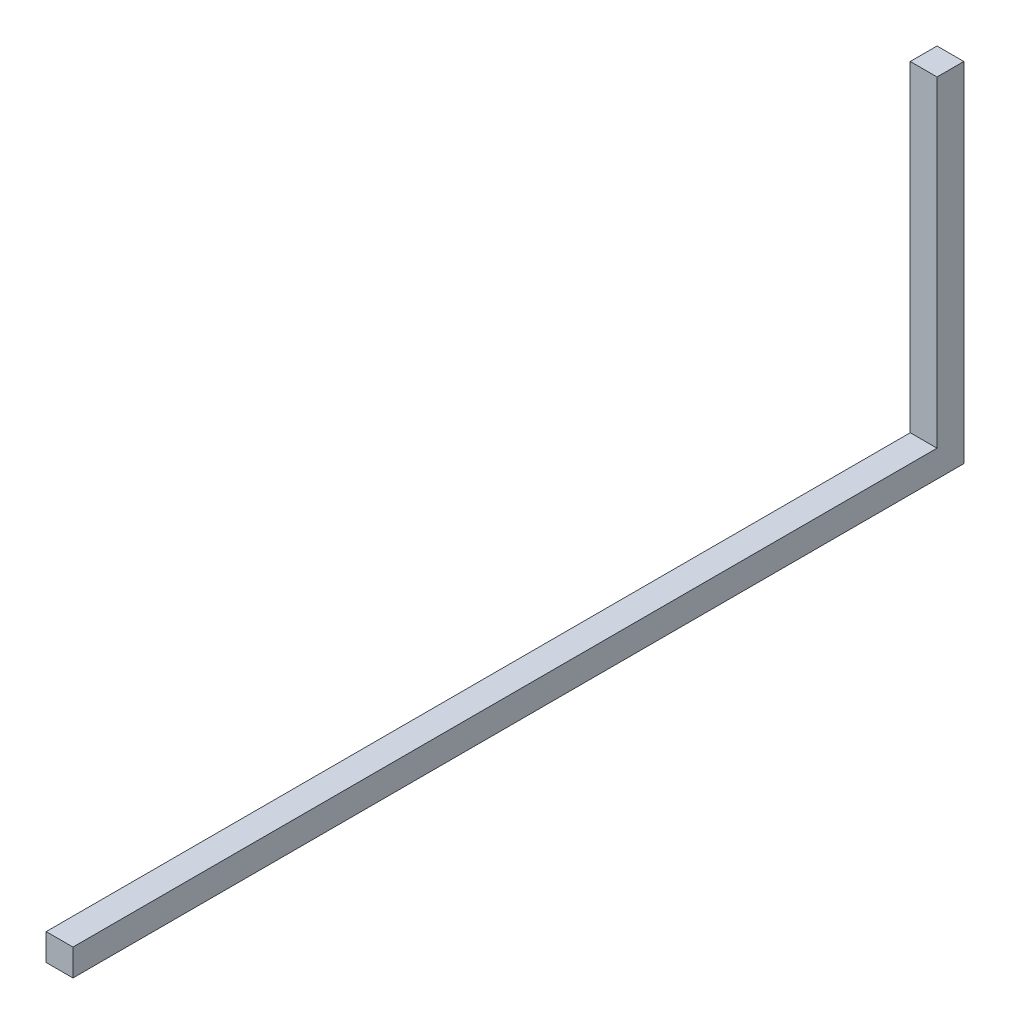
ISO-10303-21;
HEADER;
FILE_DESCRIPTION(('STEP AP214'),'2;1');
FILE_NAME('part.step','',(''),(''),'','','');
FILE_SCHEMA(('AUTOMOTIVE_DESIGN { 1 0 10303 214 1 1 1 1 }'));
ENDSEC;
DATA;
#1=APPLICATION_CONTEXT('core data for automotive mechanical design processes');
#2=APPLICATION_PROTOCOL_DEFINITION('international standard','automotive_design',2000,#1);
#3=PRODUCT_CONTEXT('',#1,'mechanical');
#4=PRODUCT('Part','Part','',(#3));
#5=PRODUCT_RELATED_PRODUCT_CATEGORY('part','',(#4));
#6=PRODUCT_DEFINITION_FORMATION('','',#4);
#7=PRODUCT_DEFINITION_CONTEXT('part definition',#1,'design');
#8=PRODUCT_DEFINITION('design','',#6,#7);
#9=PRODUCT_DEFINITION_SHAPE('','',#8);
#10=(LENGTH_UNIT() NAMED_UNIT(*) SI_UNIT(.MILLI.,.METRE.));
#11=(NAMED_UNIT(*) PLANE_ANGLE_UNIT() SI_UNIT($,.RADIAN.));
#12=(NAMED_UNIT(*) SI_UNIT($,.STERADIAN.) SOLID_ANGLE_UNIT());
#13=UNCERTAINTY_MEASURE_WITH_UNIT(LENGTH_MEASURE(1.E-05),#10,'distance_accuracy_value','');
#14=(GEOMETRIC_REPRESENTATION_CONTEXT(3) GLOBAL_UNCERTAINTY_ASSIGNED_CONTEXT((#13)) GLOBAL_UNIT_ASSIGNED_CONTEXT((#10,
#11,#12)) REPRESENTATION_CONTEXT('',''));
#15=CARTESIAN_POINT('',(0.,0.,0.));
#16=DIRECTION('',(0.,0.,1.));
#17=DIRECTION('',(1.,0.,0.));
#18=AXIS2_PLACEMENT_3D('',#15,#16,#17);
#19=CARTESIAN_POINT('',(-0.2,-0.2,-13.3));
#20=DIRECTION('',(0.,0.,1.));
#21=DIRECTION('',(1.,0.,0.));
#22=AXIS2_PLACEMENT_3D('',#19,#20,#21);
#23=PLANE('',#22);
#24=DIRECTION('',(-1.,0.,0.));
#25=VECTOR('',#24,1.);
#26=CARTESIAN_POINT('',(-0.2,5.,-13.3));
#27=LINE('',#26,#25);
#28=CARTESIAN_POINT('',(0.2,5.,-13.3));
#29=VERTEX_POINT('',#28);
#30=CARTESIAN_POINT('',(-0.2,5.,-13.3));
#31=VERTEX_POINT('',#30);
#32=EDGE_CURVE('E130',#29,#31,#27,.T.);
#33=ORIENTED_EDGE('',*,*,#32,.F.);
#34=DIRECTION('',(0.,1.,0.));
#35=VECTOR('',#34,1.);
#36=CARTESIAN_POINT('',(0.2,-0.2,-13.3));
#37=LINE('',#36,#35);
#38=CARTESIAN_POINT('',(0.2,-0.2,-13.3));
#39=VERTEX_POINT('',#38);
#40=EDGE_CURVE('E121',#39,#29,#37,.T.);
#41=ORIENTED_EDGE('',*,*,#40,.F.);
#42=DIRECTION('',(1.,0.,0.));
#43=VECTOR('',#42,1.);
#44=CARTESIAN_POINT('',(-0.2,-0.2,-13.3));
#45=LINE('',#44,#43);
#46=CARTESIAN_POINT('',(-0.2,-0.2,-13.3));
#47=VERTEX_POINT('',#46);
#48=EDGE_CURVE('E110',#47,#39,#45,.T.);
#49=ORIENTED_EDGE('',*,*,#48,.F.);
#50=DIRECTION('',(0.,1.,0.));
#51=VECTOR('',#50,1.);
#52=CARTESIAN_POINT('',(-0.2,-0.2,-13.3));
#53=LINE('',#52,#51);
#54=EDGE_CURVE('E90',#47,#31,#53,.T.);
#55=ORIENTED_EDGE('',*,*,#54,.T.);
#56=EDGE_LOOP('',(#33,#41,#49,#55));
#57=FACE_BOUND('',#56,.T.);
#58=ADVANCED_FACE('F34',(#57),#23,.F.);
#59=CARTESIAN_POINT('',(-0.2,0.2,-12.9));
#60=DIRECTION('',(0.,0.,-1.));
#61=DIRECTION('',(-1.,0.,0.));
#62=AXIS2_PLACEMENT_3D('',#59,#60,#61);
#63=PLANE('',#62);
#64=DIRECTION('',(1.,0.,0.));
#65=VECTOR('',#64,1.);
#66=CARTESIAN_POINT('',(-0.2,5.,-12.9));
#67=LINE('',#66,#65);
#68=CARTESIAN_POINT('',(-0.2,5.,-12.9));
#69=VERTEX_POINT('',#68);
#70=CARTESIAN_POINT('',(0.2,5.,-12.9));
#71=VERTEX_POINT('',#70);
#72=EDGE_CURVE('E12',#69,#71,#67,.T.);
#73=ORIENTED_EDGE('',*,*,#72,.F.);
#74=DIRECTION('',(0.,1.,0.));
#75=VECTOR('',#74,1.);
#76=CARTESIAN_POINT('',(-0.2,0.2,-12.9));
#77=LINE('',#76,#75);
#78=CARTESIAN_POINT('',(-0.2,0.2,-12.9));
#79=VERTEX_POINT('',#78);
#80=EDGE_CURVE('E127',#79,#69,#77,.T.);
#81=ORIENTED_EDGE('',*,*,#80,.F.);
#82=DIRECTION('',(-1.,0.,0.));
#83=VECTOR('',#82,1.);
#84=CARTESIAN_POINT('',(-0.2,0.2,-12.9));
#85=LINE('',#84,#83);
#86=CARTESIAN_POINT('',(0.2,0.2,-12.9));
#87=VERTEX_POINT('',#86);
#88=EDGE_CURVE('E122',#87,#79,#85,.T.);
#89=ORIENTED_EDGE('',*,*,#88,.F.);
#90=DIRECTION('',(0.,1.,0.));
#91=VECTOR('',#90,1.);
#92=CARTESIAN_POINT('',(0.2,0.2,-12.9));
#93=LINE('',#92,#91);
#94=EDGE_CURVE('E125',#87,#71,#93,.T.);
#95=ORIENTED_EDGE('',*,*,#94,.T.);
#96=EDGE_LOOP('',(#73,#81,#89,#95));
#97=FACE_BOUND('',#96,.T.);
#98=ADVANCED_FACE('F36',(#97),#63,.F.);
#99=CARTESIAN_POINT('',(0.,0.,0.));
#100=DIRECTION('',(0.,0.,-1.));
#101=DIRECTION('',(-1.,0.,0.));
#102=AXIS2_PLACEMENT_3D('',#99,#100,#101);
#103=PLANE('',#102);
#104=DIRECTION('',(0.,-1.,0.));
#105=VECTOR('',#104,1.);
#106=CARTESIAN_POINT('',(-0.2,-0.2,0.));
#107=LINE('',#106,#105);
#108=CARTESIAN_POINT('',(-0.2,0.2,0.));
#109=VERTEX_POINT('',#108);
#110=CARTESIAN_POINT('',(-0.2,-0.2,0.));
#111=VERTEX_POINT('',#110);
#112=EDGE_CURVE('E86',#109,#111,#107,.T.);
#113=ORIENTED_EDGE('',*,*,#112,.T.);
#114=DIRECTION('',(1.,0.,0.));
#115=VECTOR('',#114,1.);
#116=CARTESIAN_POINT('',(-0.2,-0.2,0.));
#117=LINE('',#116,#115);
#118=CARTESIAN_POINT('',(0.2,-0.2,0.));
#119=VERTEX_POINT('',#118);
#120=EDGE_CURVE('E98',#111,#119,#117,.T.);
#121=ORIENTED_EDGE('',*,*,#120,.T.);
#122=DIRECTION('',(0.,1.,0.));
#123=VECTOR('',#122,1.);
#124=CARTESIAN_POINT('',(0.2,-0.2,0.));
#125=LINE('',#124,#123);
#126=CARTESIAN_POINT('',(0.2,0.2,0.));
#127=VERTEX_POINT('',#126);
#128=EDGE_CURVE('E104',#119,#127,#125,.T.);
#129=ORIENTED_EDGE('',*,*,#128,.T.);
#130=DIRECTION('',(-1.,0.,0.));
#131=VECTOR('',#130,1.);
#132=CARTESIAN_POINT('',(-0.2,0.2,0.));
#133=LINE('',#132,#131);
#134=EDGE_CURVE('E95',#127,#109,#133,.T.);
#135=ORIENTED_EDGE('',*,*,#134,.T.);
#136=EDGE_LOOP('',(#113,#121,#129,#135));
#137=FACE_BOUND('',#136,.T.);
#138=ADVANCED_FACE('F106',(#137),#103,.F.);
#139=CARTESIAN_POINT('',(-0.2,-0.2,-13.6656854249492));
#140=DIRECTION('',(-1.,0.,0.));
#141=DIRECTION('',(0.,0.,1.));
#142=AXIS2_PLACEMENT_3D('',#139,#140,#141);
#143=PLANE('',#142);
#144=DIRECTION('',(0.,0.,1.));
#145=VECTOR('',#144,1.);
#146=CARTESIAN_POINT('',(-0.2,0.2,-13.6656854249492));
#147=LINE('',#146,#145);
#148=EDGE_CURVE('E115',#79,#109,#147,.T.);
#149=ORIENTED_EDGE('',*,*,#148,.F.);
#150=ORIENTED_EDGE('',*,*,#80,.T.);
#151=DIRECTION('',(0.,0.,1.));
#152=VECTOR('',#151,1.);
#153=CARTESIAN_POINT('',(-0.2,5.,-13.4828427124746));
#154=LINE('',#153,#152);
#155=EDGE_CURVE('E43',#31,#69,#154,.T.);
#156=ORIENTED_EDGE('',*,*,#155,.F.);
#157=ORIENTED_EDGE('',*,*,#54,.F.);
#158=DIRECTION('',(0.,0.,1.));
#159=VECTOR('',#158,1.);
#160=CARTESIAN_POINT('',(-0.2,-0.2,-13.6656854249492));
#161=LINE('',#160,#159);
#162=EDGE_CURVE('E81',#47,#111,#161,.T.);
#163=ORIENTED_EDGE('',*,*,#162,.T.);
#164=ORIENTED_EDGE('',*,*,#112,.F.);
#165=EDGE_LOOP('',(#149,#150,#156,#157,#163,#164));
#166=FACE_BOUND('',#165,.T.);
#167=ADVANCED_FACE('F84',(#166),#143,.T.);
#168=CARTESIAN_POINT('',(-0.2,0.2,-13.6656854249492));
#169=DIRECTION('',(0.,1.,0.));
#170=DIRECTION('',(0.,0.,1.));
#171=AXIS2_PLACEMENT_3D('',#168,#169,#170);
#172=PLANE('',#171);
#173=DIRECTION('',(0.,0.,1.));
#174=VECTOR('',#173,1.);
#175=CARTESIAN_POINT('',(0.2,0.2,-13.6656854249492));
#176=LINE('',#175,#174);
#177=EDGE_CURVE('E117',#87,#127,#176,.T.);
#178=ORIENTED_EDGE('',*,*,#177,.F.);
#179=ORIENTED_EDGE('',*,*,#88,.T.);
#180=ORIENTED_EDGE('',*,*,#148,.T.);
#181=ORIENTED_EDGE('',*,*,#134,.F.);
#182=EDGE_LOOP('',(#178,#179,#180,#181));
#183=FACE_BOUND('',#182,.T.);
#184=ADVANCED_FACE('F142',(#183),#172,.T.);
#185=CARTESIAN_POINT('',(0.2,-0.2,-13.6656854249492));
#186=DIRECTION('',(1.,0.,0.));
#187=DIRECTION('',(0.,0.,-1.));
#188=AXIS2_PLACEMENT_3D('',#185,#186,#187);
#189=PLANE('',#188);
#190=DIRECTION('',(0.,0.,1.));
#191=VECTOR('',#190,1.);
#192=CARTESIAN_POINT('',(0.2,-0.2,-13.6656854249492));
#193=LINE('',#192,#191);
#194=EDGE_CURVE('E94',#39,#119,#193,.T.);
#195=ORIENTED_EDGE('',*,*,#194,.F.);
#196=ORIENTED_EDGE('',*,*,#40,.T.);
#197=DIRECTION('',(0.,0.,-1.));
#198=VECTOR('',#197,1.);
#199=CARTESIAN_POINT('',(0.2,5.,-13.4828427124746));
#200=LINE('',#199,#198);
#201=EDGE_CURVE('E129',#71,#29,#200,.T.);
#202=ORIENTED_EDGE('',*,*,#201,.F.);
#203=ORIENTED_EDGE('',*,*,#94,.F.);
#204=ORIENTED_EDGE('',*,*,#177,.T.);
#205=ORIENTED_EDGE('',*,*,#128,.F.);
#206=EDGE_LOOP('',(#195,#196,#202,#203,#204,#205));
#207=FACE_BOUND('',#206,.T.);
#208=ADVANCED_FACE('F141',(#207),#189,.T.);
#209=CARTESIAN_POINT('',(-0.2,-0.2,-13.6656854249492));
#210=DIRECTION('',(0.,-1.,0.));
#211=DIRECTION('',(0.,0.,-1.));
#212=AXIS2_PLACEMENT_3D('',#209,#210,#211);
#213=PLANE('',#212);
#214=ORIENTED_EDGE('',*,*,#162,.F.);
#215=ORIENTED_EDGE('',*,*,#48,.T.);
#216=ORIENTED_EDGE('',*,*,#194,.T.);
#217=ORIENTED_EDGE('',*,*,#120,.F.);
#218=EDGE_LOOP('',(#214,#215,#216,#217));
#219=FACE_BOUND('',#218,.T.);
#220=ADVANCED_FACE('F99',(#219),#213,.T.);
#221=CARTESIAN_POINT('',(0.,5.,-13.1));
#222=DIRECTION('',(0.,1.,0.));
#223=DIRECTION('',(0.,0.,1.));
#224=AXIS2_PLACEMENT_3D('',#221,#222,#223);
#225=PLANE('',#224);
#226=ORIENTED_EDGE('',*,*,#155,.T.);
#227=ORIENTED_EDGE('',*,*,#72,.T.);
#228=ORIENTED_EDGE('',*,*,#201,.T.);
#229=ORIENTED_EDGE('',*,*,#32,.T.);
#230=EDGE_LOOP('',(#226,#227,#228,#229));
#231=FACE_BOUND('',#230,.T.);
#232=ADVANCED_FACE('F159',(#231),#225,.T.);
#233=CLOSED_SHELL('',(#58,#98,#138,#167,#184,#208,#220,#232));
#234=MANIFOLD_SOLID_BREP('B2',#233);
#235=ADVANCED_BREP_SHAPE_REPRESENTATION('',(#18,#234),#14);
#236=SHAPE_DEFINITION_REPRESENTATION(#9,#235);
ENDSEC;
END-ISO-10303-21;
